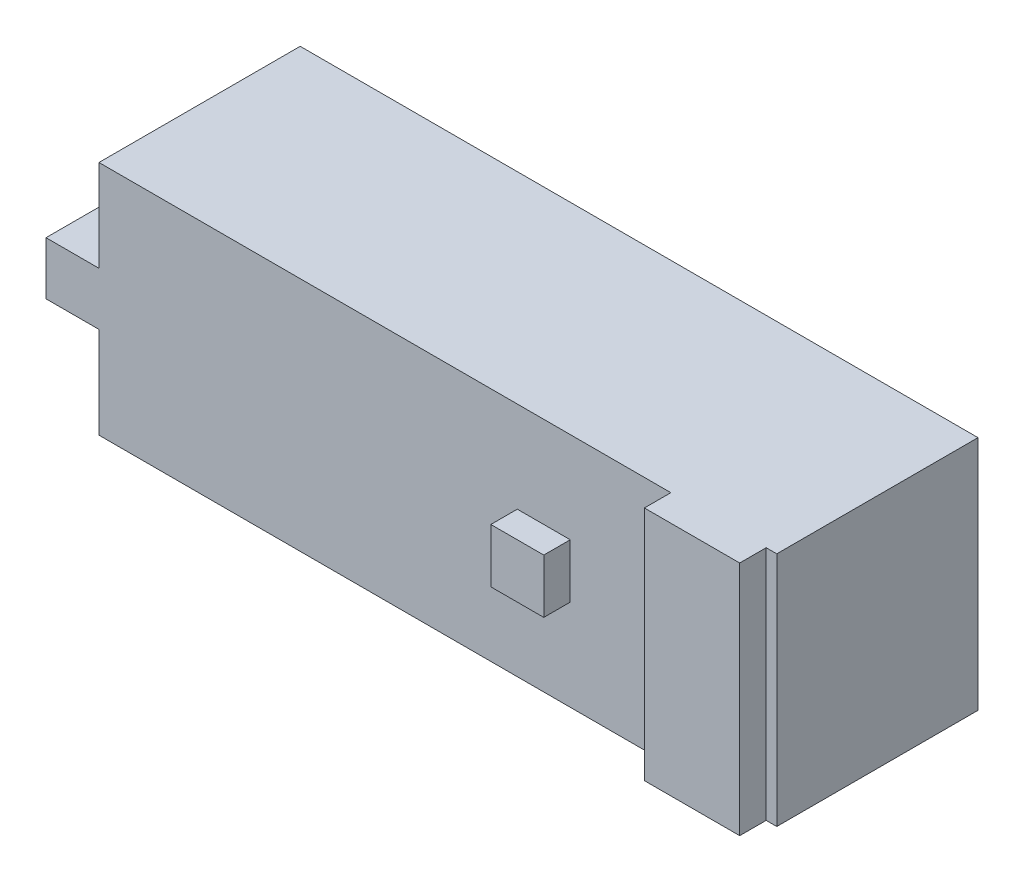
ISO-10303-21;
HEADER;
FILE_DESCRIPTION(('STEP AP214'),'2;1');
FILE_NAME('part.step','',(''),(''),'','','');
FILE_SCHEMA(('AUTOMOTIVE_DESIGN { 1 0 10303 214 1 1 1 1 }'));
ENDSEC;
DATA;
#1=APPLICATION_CONTEXT('core data for automotive mechanical design processes');
#2=APPLICATION_PROTOCOL_DEFINITION('international standard','automotive_design',2000,#1);
#3=PRODUCT_CONTEXT('',#1,'mechanical');
#4=PRODUCT('Part','Part','',(#3));
#5=PRODUCT_RELATED_PRODUCT_CATEGORY('part','',(#4));
#6=PRODUCT_DEFINITION_FORMATION('','',#4);
#7=PRODUCT_DEFINITION_CONTEXT('part definition',#1,'design');
#8=PRODUCT_DEFINITION('design','',#6,#7);
#9=PRODUCT_DEFINITION_SHAPE('','',#8);
#10=(LENGTH_UNIT() NAMED_UNIT(*) SI_UNIT(.MILLI.,.METRE.));
#11=(NAMED_UNIT(*) PLANE_ANGLE_UNIT() SI_UNIT($,.RADIAN.));
#12=(NAMED_UNIT(*) SI_UNIT($,.STERADIAN.) SOLID_ANGLE_UNIT());
#13=UNCERTAINTY_MEASURE_WITH_UNIT(LENGTH_MEASURE(1.E-05),#10,'distance_accuracy_value','');
#14=(GEOMETRIC_REPRESENTATION_CONTEXT(3) GLOBAL_UNCERTAINTY_ASSIGNED_CONTEXT((#13)) GLOBAL_UNIT_ASSIGNED_CONTEXT((#10,
#11,#12)) REPRESENTATION_CONTEXT('',''));
#15=CARTESIAN_POINT('',(0.,0.,0.));
#16=DIRECTION('',(0.,0.,1.));
#17=DIRECTION('',(1.,0.,0.));
#18=AXIS2_PLACEMENT_3D('',#15,#16,#17);
#19=CARTESIAN_POINT('',(0.,0.,19.));
#20=DIRECTION('',(0.,0.,1.));
#21=DIRECTION('',(1.,0.,0.));
#22=AXIS2_PLACEMENT_3D('',#19,#20,#21);
#23=PLANE('',#22);
#24=DIRECTION('',(1.,0.,0.));
#25=VECTOR('',#24,1.);
#26=CARTESIAN_POINT('',(0.,-2.55,19.));
#27=LINE('',#26,#25);
#28=CARTESIAN_POINT('',(7.49999999999999,-2.55,19.));
#29=VERTEX_POINT('',#28);
#30=CARTESIAN_POINT('',(12.5,-2.55,19.));
#31=VERTEX_POINT('',#30);
#32=EDGE_CURVE('E226',#29,#31,#27,.T.);
#33=ORIENTED_EDGE('',*,*,#32,.F.);
#34=DIRECTION('',(0.,-1.,0.));
#35=VECTOR('',#34,1.);
#36=CARTESIAN_POINT('',(7.49999999999999,0.,19.));
#37=LINE('',#36,#35);
#38=CARTESIAN_POINT('',(7.49999999999999,2.55,19.));
#39=VERTEX_POINT('',#38);
#40=EDGE_CURVE('E223',#39,#29,#37,.T.);
#41=ORIENTED_EDGE('',*,*,#40,.F.);
#42=DIRECTION('',(1.,0.,0.));
#43=VECTOR('',#42,1.);
#44=CARTESIAN_POINT('',(0.,2.55,19.));
#45=LINE('',#44,#43);
#46=CARTESIAN_POINT('',(12.5,2.55,19.));
#47=VERTEX_POINT('',#46);
#48=EDGE_CURVE('E236',#39,#47,#45,.T.);
#49=ORIENTED_EDGE('',*,*,#48,.T.);
#50=DIRECTION('',(0.,-1.,0.));
#51=VECTOR('',#50,1.);
#52=CARTESIAN_POINT('',(12.5,0.,19.));
#53=LINE('',#52,#51);
#54=EDGE_CURVE('E247',#47,#31,#53,.T.);
#55=ORIENTED_EDGE('',*,*,#54,.T.);
#56=EDGE_LOOP('',(#33,#41,#49,#55));
#57=FACE_BOUND('',#56,.T.);
#58=DIRECTION('',(1.,0.,0.));
#59=VECTOR('',#58,1.);
#60=CARTESIAN_POINT('',(0.,-11.15,19.));
#61=LINE('',#60,#59);
#62=CARTESIAN_POINT('',(-32.,-11.15,19.));
#63=VERTEX_POINT('',#62);
#64=CARTESIAN_POINT('',(22.,-11.15,19.));
#65=VERTEX_POINT('',#64);
#66=EDGE_CURVE('E341',#63,#65,#61,.T.);
#67=ORIENTED_EDGE('',*,*,#66,.T.);
#68=DIRECTION('',(0.,-1.,0.));
#69=VECTOR('',#68,1.);
#70=CARTESIAN_POINT('',(22.,0.,19.));
#71=LINE('',#70,#69);
#72=CARTESIAN_POINT('',(22.,11.15,19.));
#73=VERTEX_POINT('',#72);
#74=EDGE_CURVE('E60',#73,#65,#71,.T.);
#75=ORIENTED_EDGE('',*,*,#74,.F.);
#76=DIRECTION('',(1.,0.,0.));
#77=VECTOR('',#76,1.);
#78=CARTESIAN_POINT('',(0.,11.15,19.));
#79=LINE('',#78,#77);
#80=CARTESIAN_POINT('',(-32.,11.15,19.));
#81=VERTEX_POINT('',#80);
#82=EDGE_CURVE('E222',#81,#73,#79,.T.);
#83=ORIENTED_EDGE('',*,*,#82,.F.);
#84=DIRECTION('',(0.,-1.,0.));
#85=VECTOR('',#84,1.);
#86=CARTESIAN_POINT('',(-32.,0.,19.));
#87=LINE('',#86,#85);
#88=CARTESIAN_POINT('',(-32.,2.5,19.));
#89=VERTEX_POINT('',#88);
#90=EDGE_CURVE('E331',#81,#89,#87,.T.);
#91=ORIENTED_EDGE('',*,*,#90,.T.);
#92=DIRECTION('',(-1.,0.,0.));
#93=VECTOR('',#92,1.);
#94=CARTESIAN_POINT('',(0.,2.5,19.));
#95=LINE('',#94,#93);
#96=CARTESIAN_POINT('',(-37.,2.5,19.));
#97=VERTEX_POINT('',#96);
#98=EDGE_CURVE('E333',#89,#97,#95,.T.);
#99=ORIENTED_EDGE('',*,*,#98,.T.);
#100=DIRECTION('',(0.,-1.,0.));
#101=VECTOR('',#100,1.);
#102=CARTESIAN_POINT('',(-37.,0.,19.));
#103=LINE('',#102,#101);
#104=CARTESIAN_POINT('',(-37.,-2.5,19.));
#105=VERTEX_POINT('',#104);
#106=EDGE_CURVE('E336',#97,#105,#103,.T.);
#107=ORIENTED_EDGE('',*,*,#106,.T.);
#108=DIRECTION('',(-1.,0.,0.));
#109=VECTOR('',#108,1.);
#110=CARTESIAN_POINT('',(0.,-2.5,19.));
#111=LINE('',#110,#109);
#112=CARTESIAN_POINT('',(-32.,-2.5,19.));
#113=VERTEX_POINT('',#112);
#114=EDGE_CURVE('E338',#113,#105,#111,.T.);
#115=ORIENTED_EDGE('',*,*,#114,.F.);
#116=EDGE_CURVE('E334',#113,#63,#87,.T.);
#117=ORIENTED_EDGE('',*,*,#116,.T.);
#118=EDGE_LOOP('',(#67,#75,#83,#91,#99,#107,#115,#117));
#119=FACE_BOUND('',#118,.T.);
#120=ADVANCED_FACE('F37',(#57,#119),#23,.T.);
#121=DIRECTION('',(0.,-1.,0.));
#122=VECTOR('',#121,1.);
#123=CARTESIAN_POINT('',(31.,0.,19.));
#124=LINE('',#123,#122);
#125=CARTESIAN_POINT('',(31.,11.15,19.));
#126=VERTEX_POINT('',#125);
#127=CARTESIAN_POINT('',(31.,-11.15,19.));
#128=VERTEX_POINT('',#127);
#129=EDGE_CURVE('E218',#126,#128,#124,.T.);
#130=ORIENTED_EDGE('',*,*,#129,.T.);
#131=CARTESIAN_POINT('',(32.,-11.15,19.));
#132=VERTEX_POINT('',#131);
#133=EDGE_CURVE('E344',#128,#132,#61,.T.);
#134=ORIENTED_EDGE('',*,*,#133,.T.);
#135=DIRECTION('',(0.,-1.,0.));
#136=VECTOR('',#135,1.);
#137=CARTESIAN_POINT('',(32.,0.,19.));
#138=LINE('',#137,#136);
#139=CARTESIAN_POINT('',(32.,11.15,19.));
#140=VERTEX_POINT('',#139);
#141=EDGE_CURVE('E326',#140,#132,#138,.T.);
#142=ORIENTED_EDGE('',*,*,#141,.F.);
#143=EDGE_CURVE('E52',#126,#140,#79,.T.);
#144=ORIENTED_EDGE('',*,*,#143,.F.);
#145=EDGE_LOOP('',(#130,#134,#142,#144));
#146=FACE_BOUND('',#145,.T.);
#147=ADVANCED_FACE('F411',(#146),#23,.T.);
#148=CARTESIAN_POINT('',(0.,0.,0.));
#149=DIRECTION('',(0.,0.,1.));
#150=DIRECTION('',(1.,0.,0.));
#151=AXIS2_PLACEMENT_3D('',#148,#149,#150);
#152=PLANE('',#151);
#153=DIRECTION('',(0.,1.,0.));
#154=VECTOR('',#153,1.);
#155=CARTESIAN_POINT('',(7.49999999999999,2.55,0.));
#156=LINE('',#155,#154);
#157=CARTESIAN_POINT('',(7.49999999999999,-2.55,0.));
#158=VERTEX_POINT('',#157);
#159=CARTESIAN_POINT('',(7.49999999999999,2.55,0.));
#160=VERTEX_POINT('',#159);
#161=EDGE_CURVE('E264',#158,#160,#156,.T.);
#162=ORIENTED_EDGE('',*,*,#161,.F.);
#163=DIRECTION('',(-1.,0.,0.));
#164=VECTOR('',#163,1.);
#165=CARTESIAN_POINT('',(7.49999999999999,-2.55,0.));
#166=LINE('',#165,#164);
#167=CARTESIAN_POINT('',(12.5,-2.55,0.));
#168=VERTEX_POINT('',#167);
#169=EDGE_CURVE('E269',#168,#158,#166,.T.);
#170=ORIENTED_EDGE('',*,*,#169,.F.);
#171=DIRECTION('',(0.,-1.,0.));
#172=VECTOR('',#171,1.);
#173=CARTESIAN_POINT('',(12.5,2.55,0.));
#174=LINE('',#173,#172);
#175=CARTESIAN_POINT('',(12.5,2.55,0.));
#176=VERTEX_POINT('',#175);
#177=EDGE_CURVE('E281',#176,#168,#174,.T.);
#178=ORIENTED_EDGE('',*,*,#177,.F.);
#179=DIRECTION('',(1.,0.,0.));
#180=VECTOR('',#179,1.);
#181=CARTESIAN_POINT('',(7.49999999999999,2.55,0.));
#182=LINE('',#181,#180);
#183=EDGE_CURVE('E278',#160,#176,#182,.T.);
#184=ORIENTED_EDGE('',*,*,#183,.F.);
#185=EDGE_LOOP('',(#162,#170,#178,#184));
#186=FACE_BOUND('',#185,.T.);
#187=DIRECTION('',(0.,-1.,0.));
#188=VECTOR('',#187,1.);
#189=CARTESIAN_POINT('',(32.,0.,0.));
#190=LINE('',#189,#188);
#191=CARTESIAN_POINT('',(32.,11.15,0.));
#192=VERTEX_POINT('',#191);
#193=CARTESIAN_POINT('',(32.,-11.15,0.));
#194=VERTEX_POINT('',#193);
#195=EDGE_CURVE('E318',#192,#194,#190,.T.);
#196=ORIENTED_EDGE('',*,*,#195,.T.);
#197=DIRECTION('',(1.,0.,0.));
#198=VECTOR('',#197,1.);
#199=CARTESIAN_POINT('',(0.,-11.15,0.));
#200=LINE('',#199,#198);
#201=CARTESIAN_POINT('',(-32.,-11.15,0.));
#202=VERTEX_POINT('',#201);
#203=EDGE_CURVE('E329',#202,#194,#200,.T.);
#204=ORIENTED_EDGE('',*,*,#203,.F.);
#205=DIRECTION('',(0.,-1.,0.));
#206=VECTOR('',#205,1.);
#207=CARTESIAN_POINT('',(-32.,0.,0.));
#208=LINE('',#207,#206);
#209=CARTESIAN_POINT('',(-32.,-2.5,0.));
#210=VERTEX_POINT('',#209);
#211=EDGE_CURVE('E353',#210,#202,#208,.T.);
#212=ORIENTED_EDGE('',*,*,#211,.F.);
#213=DIRECTION('',(-1.,0.,0.));
#214=VECTOR('',#213,1.);
#215=CARTESIAN_POINT('',(0.,-2.5,0.));
#216=LINE('',#215,#214);
#217=CARTESIAN_POINT('',(-37.,-2.5,0.));
#218=VERTEX_POINT('',#217);
#219=EDGE_CURVE('E358',#210,#218,#216,.T.);
#220=ORIENTED_EDGE('',*,*,#219,.T.);
#221=DIRECTION('',(0.,-1.,0.));
#222=VECTOR('',#221,1.);
#223=CARTESIAN_POINT('',(-37.,0.,0.));
#224=LINE('',#223,#222);
#225=CARTESIAN_POINT('',(-37.,2.5,0.));
#226=VERTEX_POINT('',#225);
#227=EDGE_CURVE('E355',#226,#218,#224,.T.);
#228=ORIENTED_EDGE('',*,*,#227,.F.);
#229=DIRECTION('',(-1.,0.,0.));
#230=VECTOR('',#229,1.);
#231=CARTESIAN_POINT('',(0.,2.5,0.));
#232=LINE('',#231,#230);
#233=CARTESIAN_POINT('',(-32.,2.5,0.));
#234=VERTEX_POINT('',#233);
#235=EDGE_CURVE('E352',#234,#226,#232,.T.);
#236=ORIENTED_EDGE('',*,*,#235,.F.);
#237=CARTESIAN_POINT('',(-32.,11.15,0.));
#238=VERTEX_POINT('',#237);
#239=EDGE_CURVE('E350',#238,#234,#208,.T.);
#240=ORIENTED_EDGE('',*,*,#239,.F.);
#241=DIRECTION('',(1.,0.,0.));
#242=VECTOR('',#241,1.);
#243=CARTESIAN_POINT('',(0.,11.15,0.));
#244=LINE('',#243,#242);
#245=EDGE_CURVE('E347',#238,#192,#244,.T.);
#246=ORIENTED_EDGE('',*,*,#245,.T.);
#247=EDGE_LOOP('',(#196,#204,#212,#220,#228,#236,#240,#246));
#248=FACE_BOUND('',#247,.T.);
#249=DIRECTION('',(1.,0.,0.));
#250=VECTOR('',#249,1.);
#251=CARTESIAN_POINT('',(0.,1.825,0.));
#252=LINE('',#251,#250);
#253=CARTESIAN_POINT('',(-23.,1.825,0.));
#254=VERTEX_POINT('',#253);
#255=CARTESIAN_POINT('',(-19.,1.825,0.));
#256=VERTEX_POINT('',#255);
#257=EDGE_CURVE('E297',#254,#256,#252,.T.);
#258=ORIENTED_EDGE('',*,*,#257,.F.);
#259=CARTESIAN_POINT('',(-21.,0.,0.));
#260=DIRECTION('',(0.,0.,1.));
#261=DIRECTION('',(1.,0.,0.));
#262=AXIS2_PLACEMENT_3D('',#259,#260,#261);
#263=CIRCLE('',#262,2.70751269618445);
#264=CARTESIAN_POINT('',(-23.,-1.825,0.));
#265=VERTEX_POINT('',#264);
#266=EDGE_CURVE('E310',#254,#265,#263,.T.);
#267=ORIENTED_EDGE('',*,*,#266,.T.);
#268=DIRECTION('',(1.,0.,0.));
#269=VECTOR('',#268,1.);
#270=CARTESIAN_POINT('',(0.,-1.825,0.));
#271=LINE('',#270,#269);
#272=CARTESIAN_POINT('',(-19.,-1.825,0.));
#273=VERTEX_POINT('',#272);
#274=EDGE_CURVE('E313',#265,#273,#271,.T.);
#275=ORIENTED_EDGE('',*,*,#274,.T.);
#276=EDGE_CURVE('E301',#273,#256,#263,.T.);
#277=ORIENTED_EDGE('',*,*,#276,.T.);
#278=EDGE_LOOP('',(#258,#267,#275,#277));
#279=FACE_BOUND('',#278,.T.);
#280=CARTESIAN_POINT('',(-10.,0.,0.));
#281=DIRECTION('',(0.,0.,1.));
#282=DIRECTION('',(1.,0.,0.));
#283=AXIS2_PLACEMENT_3D('',#280,#281,#282);
#284=CIRCLE('',#283,2.1);
#285=CARTESIAN_POINT('',(-7.90000000000001,0.,0.));
#286=VERTEX_POINT('',#285);
#287=EDGE_CURVE('E11',#286,#286,#284,.F.);
#288=ORIENTED_EDGE('',*,*,#287,.F.);
#289=EDGE_LOOP('',(#288));
#290=FACE_BOUND('',#289,.T.);
#291=ADVANCED_FACE('F385',(#186,#248,#279,#290),#152,.F.);
#292=CARTESIAN_POINT('',(32.,0.,19.));
#293=DIRECTION('',(1.,0.,0.));
#294=DIRECTION('',(0.,1.,0.));
#295=AXIS2_PLACEMENT_3D('',#292,#293,#294);
#296=PLANE('',#295);
#297=ORIENTED_EDGE('',*,*,#195,.F.);
#298=DIRECTION('',(0.,0.,-1.));
#299=VECTOR('',#298,1.);
#300=CARTESIAN_POINT('',(32.,11.15,19.));
#301=LINE('',#300,#299);
#302=EDGE_CURVE('E45',#140,#192,#301,.T.);
#303=ORIENTED_EDGE('',*,*,#302,.F.);
#304=ORIENTED_EDGE('',*,*,#141,.T.);
#305=DIRECTION('',(0.,0.,-1.));
#306=VECTOR('',#305,1.);
#307=CARTESIAN_POINT('',(32.,-11.15,19.));
#308=LINE('',#307,#306);
#309=EDGE_CURVE('E343',#132,#194,#308,.T.);
#310=ORIENTED_EDGE('',*,*,#309,.T.);
#311=EDGE_LOOP('',(#297,#303,#304,#310));
#312=FACE_BOUND('',#311,.T.);
#313=ADVANCED_FACE('F39',(#312),#296,.T.);
#314=CARTESIAN_POINT('',(0.,11.15,19.));
#315=DIRECTION('',(0.,1.,0.));
#316=DIRECTION('',(0.,0.,1.));
#317=AXIS2_PLACEMENT_3D('',#314,#315,#316);
#318=PLANE('',#317);
#319=ORIENTED_EDGE('',*,*,#245,.F.);
#320=DIRECTION('',(0.,0.,-1.));
#321=VECTOR('',#320,1.);
#322=CARTESIAN_POINT('',(-32.,11.15,19.));
#323=LINE('',#322,#321);
#324=EDGE_CURVE('E377',#81,#238,#323,.T.);
#325=ORIENTED_EDGE('',*,*,#324,.F.);
#326=ORIENTED_EDGE('',*,*,#82,.T.);
#327=DIRECTION('',(0.,0.,-1.));
#328=VECTOR('',#327,1.);
#329=CARTESIAN_POINT('',(22.,11.15,21.5));
#330=LINE('',#329,#328);
#331=CARTESIAN_POINT('',(22.,11.15,21.5));
#332=VERTEX_POINT('',#331);
#333=EDGE_CURVE('E204',#332,#73,#330,.T.);
#334=ORIENTED_EDGE('',*,*,#333,.F.);
#335=DIRECTION('',(-1.,0.,0.));
#336=VECTOR('',#335,1.);
#337=CARTESIAN_POINT('',(0.,11.15,21.5));
#338=LINE('',#337,#336);
#339=CARTESIAN_POINT('',(31.,11.15,21.5));
#340=VERTEX_POINT('',#339);
#341=EDGE_CURVE('E210',#340,#332,#338,.T.);
#342=ORIENTED_EDGE('',*,*,#341,.F.);
#343=DIRECTION('',(0.,0.,-1.));
#344=VECTOR('',#343,1.);
#345=CARTESIAN_POINT('',(31.,11.15,21.5));
#346=LINE('',#345,#344);
#347=EDGE_CURVE('E422',#340,#126,#346,.T.);
#348=ORIENTED_EDGE('',*,*,#347,.T.);
#349=ORIENTED_EDGE('',*,*,#143,.T.);
#350=ORIENTED_EDGE('',*,*,#302,.T.);
#351=EDGE_LOOP('',(#319,#325,#326,#334,#342,#348,#349,#350));
#352=FACE_BOUND('',#351,.T.);
#353=ADVANCED_FACE('F221',(#352),#318,.T.);
#354=CARTESIAN_POINT('',(-32.,0.,19.));
#355=DIRECTION('',(1.,0.,0.));
#356=DIRECTION('',(0.,0.,-1.));
#357=AXIS2_PLACEMENT_3D('',#354,#355,#356);
#358=PLANE('',#357);
#359=ORIENTED_EDGE('',*,*,#239,.T.);
#360=DIRECTION('',(0.,0.,-1.));
#361=VECTOR('',#360,1.);
#362=CARTESIAN_POINT('',(-32.,2.5,19.));
#363=LINE('',#362,#361);
#364=EDGE_CURVE('E374',#89,#234,#363,.T.);
#365=ORIENTED_EDGE('',*,*,#364,.F.);
#366=ORIENTED_EDGE('',*,*,#90,.F.);
#367=ORIENTED_EDGE('',*,*,#324,.T.);
#368=EDGE_LOOP('',(#359,#365,#366,#367));
#369=FACE_BOUND('',#368,.T.);
#370=ADVANCED_FACE('F391',(#369),#358,.F.);
#371=CARTESIAN_POINT('',(0.,2.5,19.));
#372=DIRECTION('',(0.,-1.,0.));
#373=DIRECTION('',(1.,0.,0.));
#374=AXIS2_PLACEMENT_3D('',#371,#372,#373);
#375=PLANE('',#374);
#376=ORIENTED_EDGE('',*,*,#235,.T.);
#377=DIRECTION('',(0.,0.,-1.));
#378=VECTOR('',#377,1.);
#379=CARTESIAN_POINT('',(-37.,2.5,19.));
#380=LINE('',#379,#378);
#381=EDGE_CURVE('E371',#97,#226,#380,.T.);
#382=ORIENTED_EDGE('',*,*,#381,.F.);
#383=ORIENTED_EDGE('',*,*,#98,.F.);
#384=ORIENTED_EDGE('',*,*,#364,.T.);
#385=EDGE_LOOP('',(#376,#382,#383,#384));
#386=FACE_BOUND('',#385,.T.);
#387=ADVANCED_FACE('F395',(#386),#375,.F.);
#388=CARTESIAN_POINT('',(-37.,0.,19.));
#389=DIRECTION('',(1.,0.,0.));
#390=DIRECTION('',(0.,0.,-1.));
#391=AXIS2_PLACEMENT_3D('',#388,#389,#390);
#392=PLANE('',#391);
#393=ORIENTED_EDGE('',*,*,#227,.T.);
#394=DIRECTION('',(0.,0.,-1.));
#395=VECTOR('',#394,1.);
#396=CARTESIAN_POINT('',(-37.,-2.5,19.));
#397=LINE('',#396,#395);
#398=EDGE_CURVE('E369',#105,#218,#397,.T.);
#399=ORIENTED_EDGE('',*,*,#398,.F.);
#400=ORIENTED_EDGE('',*,*,#106,.F.);
#401=ORIENTED_EDGE('',*,*,#381,.T.);
#402=EDGE_LOOP('',(#393,#399,#400,#401));
#403=FACE_BOUND('',#402,.T.);
#404=ADVANCED_FACE('F401',(#403),#392,.F.);
#405=CARTESIAN_POINT('',(0.,-2.5,19.));
#406=DIRECTION('',(0.,-1.,0.));
#407=DIRECTION('',(1.,0.,0.));
#408=AXIS2_PLACEMENT_3D('',#405,#406,#407);
#409=PLANE('',#408);
#410=ORIENTED_EDGE('',*,*,#219,.F.);
#411=DIRECTION('',(0.,0.,-1.));
#412=VECTOR('',#411,1.);
#413=CARTESIAN_POINT('',(-32.,-2.5,19.));
#414=LINE('',#413,#412);
#415=EDGE_CURVE('E367',#113,#210,#414,.T.);
#416=ORIENTED_EDGE('',*,*,#415,.F.);
#417=ORIENTED_EDGE('',*,*,#114,.T.);
#418=ORIENTED_EDGE('',*,*,#398,.T.);
#419=EDGE_LOOP('',(#410,#416,#417,#418));
#420=FACE_BOUND('',#419,.T.);
#421=ADVANCED_FACE('F404',(#420),#409,.T.);
#422=ORIENTED_EDGE('',*,*,#211,.T.);
#423=DIRECTION('',(0.,0.,-1.));
#424=VECTOR('',#423,1.);
#425=CARTESIAN_POINT('',(-32.,-11.15,19.));
#426=LINE('',#425,#424);
#427=EDGE_CURVE('E364',#63,#202,#426,.T.);
#428=ORIENTED_EDGE('',*,*,#427,.F.);
#429=ORIENTED_EDGE('',*,*,#116,.F.);
#430=ORIENTED_EDGE('',*,*,#415,.T.);
#431=EDGE_LOOP('',(#422,#428,#429,#430));
#432=FACE_BOUND('',#431,.T.);
#433=ADVANCED_FACE('F409',(#432),#358,.F.);
#434=CARTESIAN_POINT('',(0.,-11.15,19.));
#435=DIRECTION('',(0.,1.,0.));
#436=DIRECTION('',(0.,0.,1.));
#437=AXIS2_PLACEMENT_3D('',#434,#435,#436);
#438=PLANE('',#437);
#439=ORIENTED_EDGE('',*,*,#203,.T.);
#440=ORIENTED_EDGE('',*,*,#309,.F.);
#441=ORIENTED_EDGE('',*,*,#133,.F.);
#442=DIRECTION('',(0.,0.,-1.));
#443=VECTOR('',#442,1.);
#444=CARTESIAN_POINT('',(31.,-11.15,21.5));
#445=LINE('',#444,#443);
#446=CARTESIAN_POINT('',(31.,-11.15,21.5));
#447=VERTEX_POINT('',#446);
#448=EDGE_CURVE('E228',#447,#128,#445,.T.);
#449=ORIENTED_EDGE('',*,*,#448,.F.);
#450=DIRECTION('',(1.,0.,0.));
#451=VECTOR('',#450,1.);
#452=CARTESIAN_POINT('',(0.,-11.15,21.5));
#453=LINE('',#452,#451);
#454=CARTESIAN_POINT('',(22.,-11.15,21.5));
#455=VERTEX_POINT('',#454);
#456=EDGE_CURVE('E209',#455,#447,#453,.T.);
#457=ORIENTED_EDGE('',*,*,#456,.F.);
#458=DIRECTION('',(0.,0.,-1.));
#459=VECTOR('',#458,1.);
#460=CARTESIAN_POINT('',(22.,-11.15,21.5));
#461=LINE('',#460,#459);
#462=EDGE_CURVE('E206',#455,#65,#461,.T.);
#463=ORIENTED_EDGE('',*,*,#462,.T.);
#464=ORIENTED_EDGE('',*,*,#66,.F.);
#465=ORIENTED_EDGE('',*,*,#427,.T.);
#466=EDGE_LOOP('',(#439,#440,#441,#449,#457,#463,#464,#465));
#467=FACE_BOUND('',#466,.T.);
#468=ADVANCED_FACE('F416',(#467),#438,.F.);
#469=CARTESIAN_POINT('',(0.,1.825,-8.));
#470=DIRECTION('',(0.,-1.,0.));
#471=DIRECTION('',(0.,0.,-1.));
#472=AXIS2_PLACEMENT_3D('',#469,#470,#471);
#473=PLANE('',#472);
#474=ORIENTED_EDGE('',*,*,#257,.T.);
#475=DIRECTION('',(0.,0.,1.));
#476=VECTOR('',#475,1.);
#477=CARTESIAN_POINT('',(-19.,1.825,-8.));
#478=LINE('',#477,#476);
#479=CARTESIAN_POINT('',(-19.,1.825,-8.));
#480=VERTEX_POINT('',#479);
#481=EDGE_CURVE('E316',#480,#256,#478,.T.);
#482=ORIENTED_EDGE('',*,*,#481,.F.);
#483=DIRECTION('',(1.,0.,0.));
#484=VECTOR('',#483,1.);
#485=CARTESIAN_POINT('',(0.,1.825,-8.));
#486=LINE('',#485,#484);
#487=CARTESIAN_POINT('',(-23.,1.825,-8.));
#488=VERTEX_POINT('',#487);
#489=EDGE_CURVE('E298',#488,#480,#486,.T.);
#490=ORIENTED_EDGE('',*,*,#489,.F.);
#491=DIRECTION('',(0.,0.,1.));
#492=VECTOR('',#491,1.);
#493=CARTESIAN_POINT('',(-23.,1.825,-8.));
#494=LINE('',#493,#492);
#495=EDGE_CURVE('E324',#488,#254,#494,.T.);
#496=ORIENTED_EDGE('',*,*,#495,.T.);
#497=EDGE_LOOP('',(#474,#482,#490,#496));
#498=FACE_BOUND('',#497,.T.);
#499=ADVANCED_FACE('F442',(#498),#473,.F.);
#500=CARTESIAN_POINT('',(-21.,0.,-8.));
#501=DIRECTION('',(0.,0.,1.));
#502=DIRECTION('',(1.,0.,0.));
#503=AXIS2_PLACEMENT_3D('',#500,#501,#502);
#504=CYLINDRICAL_SURFACE('',#503,2.70751269618445);
#505=ORIENTED_EDGE('',*,*,#276,.F.);
#506=DIRECTION('',(0.,0.,1.));
#507=VECTOR('',#506,1.);
#508=CARTESIAN_POINT('',(-19.,-1.825,-8.));
#509=LINE('',#508,#507);
#510=CARTESIAN_POINT('',(-19.,-1.825,-8.));
#511=VERTEX_POINT('',#510);
#512=EDGE_CURVE('E319',#511,#273,#509,.T.);
#513=ORIENTED_EDGE('',*,*,#512,.F.);
#514=CARTESIAN_POINT('',(-21.,0.,-8.));
#515=DIRECTION('',(0.,0.,1.));
#516=DIRECTION('',(1.,0.,0.));
#517=AXIS2_PLACEMENT_3D('',#514,#515,#516);
#518=CIRCLE('',#517,2.70751269618445);
#519=EDGE_CURVE('E305',#511,#480,#518,.T.);
#520=ORIENTED_EDGE('',*,*,#519,.T.);
#521=ORIENTED_EDGE('',*,*,#481,.T.);
#522=EDGE_LOOP('',(#505,#513,#520,#521));
#523=FACE_BOUND('',#522,.T.);
#524=ADVANCED_FACE('F595',(#523),#504,.T.);
#525=CARTESIAN_POINT('',(0.,-1.825,-8.));
#526=DIRECTION('',(0.,-1.,0.));
#527=DIRECTION('',(0.,0.,-1.));
#528=AXIS2_PLACEMENT_3D('',#525,#526,#527);
#529=PLANE('',#528);
#530=ORIENTED_EDGE('',*,*,#274,.F.);
#531=DIRECTION('',(0.,0.,1.));
#532=VECTOR('',#531,1.);
#533=CARTESIAN_POINT('',(-23.,-1.825,-8.));
#534=LINE('',#533,#532);
#535=CARTESIAN_POINT('',(-23.,-1.825,-8.));
#536=VERTEX_POINT('',#535);
#537=EDGE_CURVE('E321',#536,#265,#534,.T.);
#538=ORIENTED_EDGE('',*,*,#537,.F.);
#539=DIRECTION('',(1.,0.,0.));
#540=VECTOR('',#539,1.);
#541=CARTESIAN_POINT('',(0.,-1.825,-8.));
#542=LINE('',#541,#540);
#543=EDGE_CURVE('E304',#536,#511,#542,.T.);
#544=ORIENTED_EDGE('',*,*,#543,.T.);
#545=ORIENTED_EDGE('',*,*,#512,.T.);
#546=EDGE_LOOP('',(#530,#538,#544,#545));
#547=FACE_BOUND('',#546,.T.);
#548=ADVANCED_FACE('F597',(#547),#529,.T.);
#549=ORIENTED_EDGE('',*,*,#266,.F.);
#550=ORIENTED_EDGE('',*,*,#495,.F.);
#551=EDGE_CURVE('E300',#488,#536,#518,.T.);
#552=ORIENTED_EDGE('',*,*,#551,.T.);
#553=ORIENTED_EDGE('',*,*,#537,.T.);
#554=EDGE_LOOP('',(#549,#550,#552,#553));
#555=FACE_BOUND('',#554,.T.);
#556=ADVANCED_FACE('F593',(#555),#504,.T.);
#557=CARTESIAN_POINT('',(0.,0.,-8.));
#558=DIRECTION('',(0.,0.,1.));
#559=DIRECTION('',(1.,0.,0.));
#560=AXIS2_PLACEMENT_3D('',#557,#558,#559);
#561=PLANE('',#560);
#562=ORIENTED_EDGE('',*,*,#489,.T.);
#563=ORIENTED_EDGE('',*,*,#519,.F.);
#564=ORIENTED_EDGE('',*,*,#543,.F.);
#565=ORIENTED_EDGE('',*,*,#551,.F.);
#566=EDGE_LOOP('',(#562,#563,#564,#565));
#567=FACE_BOUND('',#566,.T.);
#568=ADVANCED_FACE('F589',(#567),#561,.F.);
#569=CARTESIAN_POINT('',(7.49999999999999,2.55,-2.));
#570=DIRECTION('',(1.,0.,0.));
#571=DIRECTION('',(0.,0.,-1.));
#572=AXIS2_PLACEMENT_3D('',#569,#570,#571);
#573=PLANE('',#572);
#574=ORIENTED_EDGE('',*,*,#161,.T.);
#575=DIRECTION('',(0.,0.,1.));
#576=VECTOR('',#575,1.);
#577=CARTESIAN_POINT('',(7.49999999999999,2.55,-2.));
#578=LINE('',#577,#576);
#579=CARTESIAN_POINT('',(7.49999999999999,2.55,-2.));
#580=VERTEX_POINT('',#579);
#581=EDGE_CURVE('E294',#580,#160,#578,.T.);
#582=ORIENTED_EDGE('',*,*,#581,.F.);
#583=DIRECTION('',(0.,1.,0.));
#584=VECTOR('',#583,1.);
#585=CARTESIAN_POINT('',(7.49999999999999,2.55,-2.));
#586=LINE('',#585,#584);
#587=CARTESIAN_POINT('',(7.49999999999999,-2.55,-2.));
#588=VERTEX_POINT('',#587);
#589=EDGE_CURVE('E265',#588,#580,#586,.T.);
#590=ORIENTED_EDGE('',*,*,#589,.F.);
#591=DIRECTION('',(0.,0.,1.));
#592=VECTOR('',#591,1.);
#593=CARTESIAN_POINT('',(7.49999999999999,-2.55,-2.));
#594=LINE('',#593,#592);
#595=EDGE_CURVE('E275',#588,#158,#594,.T.);
#596=ORIENTED_EDGE('',*,*,#595,.T.);
#597=EDGE_LOOP('',(#574,#582,#590,#596));
#598=FACE_BOUND('',#597,.T.);
#599=ADVANCED_FACE('F585',(#598),#573,.F.);
#600=CARTESIAN_POINT('',(7.49999999999999,2.55,-2.));
#601=DIRECTION('',(0.,-1.,0.));
#602=DIRECTION('',(0.,0.,-1.));
#603=AXIS2_PLACEMENT_3D('',#600,#601,#602);
#604=PLANE('',#603);
#605=ORIENTED_EDGE('',*,*,#183,.T.);
#606=DIRECTION('',(0.,0.,1.));
#607=VECTOR('',#606,1.);
#608=CARTESIAN_POINT('',(12.5,2.55,-2.));
#609=LINE('',#608,#607);
#610=CARTESIAN_POINT('',(12.5,2.55,-2.));
#611=VERTEX_POINT('',#610);
#612=EDGE_CURVE('E291',#611,#176,#609,.T.);
#613=ORIENTED_EDGE('',*,*,#612,.F.);
#614=DIRECTION('',(1.,0.,0.));
#615=VECTOR('',#614,1.);
#616=CARTESIAN_POINT('',(7.49999999999999,2.55,-2.));
#617=LINE('',#616,#615);
#618=EDGE_CURVE('E268',#580,#611,#617,.T.);
#619=ORIENTED_EDGE('',*,*,#618,.F.);
#620=ORIENTED_EDGE('',*,*,#581,.T.);
#621=EDGE_LOOP('',(#605,#613,#619,#620));
#622=FACE_BOUND('',#621,.T.);
#623=ADVANCED_FACE('F581',(#622),#604,.F.);
#624=CARTESIAN_POINT('',(12.5,2.55,-2.));
#625=DIRECTION('',(-1.,0.,0.));
#626=DIRECTION('',(0.,0.,1.));
#627=AXIS2_PLACEMENT_3D('',#624,#625,#626);
#628=PLANE('',#627);
#629=ORIENTED_EDGE('',*,*,#177,.T.);
#630=DIRECTION('',(0.,0.,1.));
#631=VECTOR('',#630,1.);
#632=CARTESIAN_POINT('',(12.5,-2.55,-2.));
#633=LINE('',#632,#631);
#634=CARTESIAN_POINT('',(12.5,-2.55,-2.));
#635=VERTEX_POINT('',#634);
#636=EDGE_CURVE('E288',#635,#168,#633,.T.);
#637=ORIENTED_EDGE('',*,*,#636,.F.);
#638=DIRECTION('',(0.,-1.,0.));
#639=VECTOR('',#638,1.);
#640=CARTESIAN_POINT('',(12.5,2.55,-2.));
#641=LINE('',#640,#639);
#642=EDGE_CURVE('E271',#611,#635,#641,.T.);
#643=ORIENTED_EDGE('',*,*,#642,.F.);
#644=ORIENTED_EDGE('',*,*,#612,.T.);
#645=EDGE_LOOP('',(#629,#637,#643,#644));
#646=FACE_BOUND('',#645,.T.);
#647=ADVANCED_FACE('F577',(#646),#628,.F.);
#648=CARTESIAN_POINT('',(7.49999999999999,-2.55,-2.));
#649=DIRECTION('',(0.,1.,0.));
#650=DIRECTION('',(0.,0.,1.));
#651=AXIS2_PLACEMENT_3D('',#648,#649,#650);
#652=PLANE('',#651);
#653=ORIENTED_EDGE('',*,*,#169,.T.);
#654=ORIENTED_EDGE('',*,*,#595,.F.);
#655=DIRECTION('',(-1.,0.,0.));
#656=VECTOR('',#655,1.);
#657=CARTESIAN_POINT('',(7.49999999999999,-2.55,-2.));
#658=LINE('',#657,#656);
#659=EDGE_CURVE('E273',#635,#588,#658,.T.);
#660=ORIENTED_EDGE('',*,*,#659,.F.);
#661=ORIENTED_EDGE('',*,*,#636,.T.);
#662=EDGE_LOOP('',(#653,#654,#660,#661));
#663=FACE_BOUND('',#662,.T.);
#664=ADVANCED_FACE('F573',(#663),#652,.F.);
#665=CARTESIAN_POINT('',(0.,0.,-2.));
#666=DIRECTION('',(0.,0.,1.));
#667=DIRECTION('',(1.,0.,0.));
#668=AXIS2_PLACEMENT_3D('',#665,#666,#667);
#669=PLANE('',#668);
#670=ORIENTED_EDGE('',*,*,#589,.T.);
#671=ORIENTED_EDGE('',*,*,#618,.T.);
#672=ORIENTED_EDGE('',*,*,#642,.T.);
#673=ORIENTED_EDGE('',*,*,#659,.T.);
#674=EDGE_LOOP('',(#670,#671,#672,#673));
#675=FACE_BOUND('',#674,.T.);
#676=ADVANCED_FACE('F569',(#675),#669,.F.);
#677=CARTESIAN_POINT('',(-10.,0.,-2.));
#678=DIRECTION('',(0.,0.,1.));
#679=DIRECTION('',(1.,0.,0.));
#680=AXIS2_PLACEMENT_3D('',#677,#678,#679);
#681=CYLINDRICAL_SURFACE('',#680,2.1);
#682=CARTESIAN_POINT('',(-10.,0.,-2.));
#683=DIRECTION('',(0.,0.,-1.));
#684=DIRECTION('',(-1.,0.,0.));
#685=AXIS2_PLACEMENT_3D('',#682,#683,#684);
#686=CIRCLE('',#685,2.1);
#687=CARTESIAN_POINT('',(-12.1,0.,-2.));
#688=VERTEX_POINT('',#687);
#689=EDGE_CURVE('E261',#688,#688,#686,.T.);
#690=ORIENTED_EDGE('',*,*,#689,.F.);
#691=EDGE_LOOP('',(#690));
#692=FACE_BOUND('',#691,.T.);
#693=ORIENTED_EDGE('',*,*,#287,.T.);
#694=EDGE_LOOP('',(#693));
#695=FACE_BOUND('',#694,.T.);
#696=ADVANCED_FACE('F565',(#692,#695),#681,.T.);
#697=CARTESIAN_POINT('',(-10.,0.,-2.));
#698=DIRECTION('',(0.,0.,-1.));
#699=DIRECTION('',(-1.,0.,0.));
#700=AXIS2_PLACEMENT_3D('',#697,#698,#699);
#701=PLANE('',#700);
#702=ORIENTED_EDGE('',*,*,#689,.T.);
#703=EDGE_LOOP('',(#702));
#704=FACE_BOUND('',#703,.T.);
#705=ADVANCED_FACE('F503',(#704),#701,.T.);
#706=CARTESIAN_POINT('',(7.49999999999999,0.,21.5));
#707=DIRECTION('',(1.,0.,0.));
#708=DIRECTION('',(0.,0.,-1.));
#709=AXIS2_PLACEMENT_3D('',#706,#707,#708);
#710=PLANE('',#709);
#711=ORIENTED_EDGE('',*,*,#40,.T.);
#712=DIRECTION('',(0.,0.,-1.));
#713=VECTOR('',#712,1.);
#714=CARTESIAN_POINT('',(7.49999999999999,-2.55,21.5));
#715=LINE('',#714,#713);
#716=CARTESIAN_POINT('',(7.49999999999999,-2.55,21.5));
#717=VERTEX_POINT('',#716);
#718=EDGE_CURVE('E258',#717,#29,#715,.T.);
#719=ORIENTED_EDGE('',*,*,#718,.F.);
#720=DIRECTION('',(0.,-1.,0.));
#721=VECTOR('',#720,1.);
#722=CARTESIAN_POINT('',(7.49999999999999,0.,21.5));
#723=LINE('',#722,#721);
#724=CARTESIAN_POINT('',(7.49999999999999,2.55,21.5));
#725=VERTEX_POINT('',#724);
#726=EDGE_CURVE('E232',#725,#717,#723,.T.);
#727=ORIENTED_EDGE('',*,*,#726,.F.);
#728=DIRECTION('',(0.,0.,-1.));
#729=VECTOR('',#728,1.);
#730=CARTESIAN_POINT('',(7.49999999999999,2.55,21.5));
#731=LINE('',#730,#729);
#732=EDGE_CURVE('E243',#725,#39,#731,.T.);
#733=ORIENTED_EDGE('',*,*,#732,.T.);
#734=EDGE_LOOP('',(#711,#719,#727,#733));
#735=FACE_BOUND('',#734,.T.);
#736=ADVANCED_FACE('F498',(#735),#710,.F.);
#737=CARTESIAN_POINT('',(0.,-2.55,21.5));
#738=DIRECTION('',(0.,1.,0.));
#739=DIRECTION('',(0.,0.,1.));
#740=AXIS2_PLACEMENT_3D('',#737,#738,#739);
#741=PLANE('',#740);
#742=ORIENTED_EDGE('',*,*,#32,.T.);
#743=DIRECTION('',(0.,0.,-1.));
#744=VECTOR('',#743,1.);
#745=CARTESIAN_POINT('',(12.5,-2.55,21.5));
#746=LINE('',#745,#744);
#747=CARTESIAN_POINT('',(12.5,-2.55,21.5));
#748=VERTEX_POINT('',#747);
#749=EDGE_CURVE('E255',#748,#31,#746,.T.);
#750=ORIENTED_EDGE('',*,*,#749,.F.);
#751=DIRECTION('',(1.,0.,0.));
#752=VECTOR('',#751,1.);
#753=CARTESIAN_POINT('',(0.,-2.55,21.5));
#754=LINE('',#753,#752);
#755=EDGE_CURVE('E235',#717,#748,#754,.T.);
#756=ORIENTED_EDGE('',*,*,#755,.F.);
#757=ORIENTED_EDGE('',*,*,#718,.T.);
#758=EDGE_LOOP('',(#742,#750,#756,#757));
#759=FACE_BOUND('',#758,.T.);
#760=ADVANCED_FACE('F502',(#759),#741,.F.);
#761=CARTESIAN_POINT('',(12.5,0.,21.5));
#762=DIRECTION('',(1.,0.,0.));
#763=DIRECTION('',(0.,0.,-1.));
#764=AXIS2_PLACEMENT_3D('',#761,#762,#763);
#765=PLANE('',#764);
#766=ORIENTED_EDGE('',*,*,#54,.F.);
#767=DIRECTION('',(0.,0.,-1.));
#768=VECTOR('',#767,1.);
#769=CARTESIAN_POINT('',(12.5,2.55,21.5));
#770=LINE('',#769,#768);
#771=CARTESIAN_POINT('',(12.5,2.55,21.5));
#772=VERTEX_POINT('',#771);
#773=EDGE_CURVE('E252',#772,#47,#770,.T.);
#774=ORIENTED_EDGE('',*,*,#773,.F.);
#775=DIRECTION('',(0.,-1.,0.));
#776=VECTOR('',#775,1.);
#777=CARTESIAN_POINT('',(12.5,0.,21.5));
#778=LINE('',#777,#776);
#779=EDGE_CURVE('E238',#772,#748,#778,.T.);
#780=ORIENTED_EDGE('',*,*,#779,.T.);
#781=ORIENTED_EDGE('',*,*,#749,.T.);
#782=EDGE_LOOP('',(#766,#774,#780,#781));
#783=FACE_BOUND('',#782,.T.);
#784=ADVANCED_FACE('F514',(#783),#765,.T.);
#785=CARTESIAN_POINT('',(0.,2.55,21.5));
#786=DIRECTION('',(0.,1.,0.));
#787=DIRECTION('',(0.,0.,1.));
#788=AXIS2_PLACEMENT_3D('',#785,#786,#787);
#789=PLANE('',#788);
#790=ORIENTED_EDGE('',*,*,#48,.F.);
#791=ORIENTED_EDGE('',*,*,#732,.F.);
#792=DIRECTION('',(1.,0.,0.));
#793=VECTOR('',#792,1.);
#794=CARTESIAN_POINT('',(0.,2.55,21.5));
#795=LINE('',#794,#793);
#796=EDGE_CURVE('E241',#725,#772,#795,.T.);
#797=ORIENTED_EDGE('',*,*,#796,.T.);
#798=ORIENTED_EDGE('',*,*,#773,.T.);
#799=EDGE_LOOP('',(#790,#791,#797,#798));
#800=FACE_BOUND('',#799,.T.);
#801=ADVANCED_FACE('F524',(#800),#789,.T.);
#802=CARTESIAN_POINT('',(0.,0.,21.5));
#803=DIRECTION('',(0.,0.,1.));
#804=DIRECTION('',(1.,0.,0.));
#805=AXIS2_PLACEMENT_3D('',#802,#803,#804);
#806=PLANE('',#805);
#807=ORIENTED_EDGE('',*,*,#726,.T.);
#808=ORIENTED_EDGE('',*,*,#755,.T.);
#809=ORIENTED_EDGE('',*,*,#779,.F.);
#810=ORIENTED_EDGE('',*,*,#796,.F.);
#811=EDGE_LOOP('',(#807,#808,#809,#810));
#812=FACE_BOUND('',#811,.T.);
#813=ADVANCED_FACE('F432',(#812),#806,.T.);
#814=CARTESIAN_POINT('',(22.,0.,21.5));
#815=DIRECTION('',(1.,0.,0.));
#816=DIRECTION('',(0.,1.,0.));
#817=AXIS2_PLACEMENT_3D('',#814,#815,#816);
#818=PLANE('',#817);
#819=ORIENTED_EDGE('',*,*,#74,.T.);
#820=ORIENTED_EDGE('',*,*,#462,.F.);
#821=DIRECTION('',(0.,-1.,0.));
#822=VECTOR('',#821,1.);
#823=CARTESIAN_POINT('',(22.,0.,21.5));
#824=LINE('',#823,#822);
#825=EDGE_CURVE('E200',#332,#455,#824,.T.);
#826=ORIENTED_EDGE('',*,*,#825,.F.);
#827=ORIENTED_EDGE('',*,*,#333,.T.);
#828=EDGE_LOOP('',(#819,#820,#826,#827));
#829=FACE_BOUND('',#828,.T.);
#830=ADVANCED_FACE('F202',(#829),#818,.F.);
#831=CARTESIAN_POINT('',(31.,0.,21.5));
#832=DIRECTION('',(1.,0.,0.));
#833=DIRECTION('',(0.,0.,-1.));
#834=AXIS2_PLACEMENT_3D('',#831,#832,#833);
#835=PLANE('',#834);
#836=ORIENTED_EDGE('',*,*,#129,.F.);
#837=ORIENTED_EDGE('',*,*,#347,.F.);
#838=DIRECTION('',(0.,-1.,0.));
#839=VECTOR('',#838,1.);
#840=CARTESIAN_POINT('',(31.,0.,21.5));
#841=LINE('',#840,#839);
#842=EDGE_CURVE('E216',#340,#447,#841,.T.);
#843=ORIENTED_EDGE('',*,*,#842,.T.);
#844=ORIENTED_EDGE('',*,*,#448,.T.);
#845=EDGE_LOOP('',(#836,#837,#843,#844));
#846=FACE_BOUND('',#845,.T.);
#847=ADVANCED_FACE('F424',(#846),#835,.T.);
#848=CARTESIAN_POINT('',(0.,0.,21.5));
#849=DIRECTION('',(0.,0.,1.));
#850=DIRECTION('',(1.,0.,0.));
#851=AXIS2_PLACEMENT_3D('',#848,#849,#850);
#852=PLANE('',#851);
#853=ORIENTED_EDGE('',*,*,#341,.T.);
#854=ORIENTED_EDGE('',*,*,#825,.T.);
#855=ORIENTED_EDGE('',*,*,#456,.T.);
#856=ORIENTED_EDGE('',*,*,#842,.F.);
#857=EDGE_LOOP('',(#853,#854,#855,#856));
#858=FACE_BOUND('',#857,.T.);
#859=ADVANCED_FACE('F214',(#858),#852,.T.);
#860=CLOSED_SHELL('',(#120,#147,#291,#313,#353,#370,#387,#404,#421,#433,#468,#499,#524,#548,
#556,#568,#599,#623,#647,#664,#676,#696,#705,#736,#760,#784,#801,#813,#830,#847,#859));
#861=MANIFOLD_SOLID_BREP('B2',#860);
#862=ADVANCED_BREP_SHAPE_REPRESENTATION('',(#18,#861),#14);
#863=SHAPE_DEFINITION_REPRESENTATION(#9,#862);
ENDSEC;
END-ISO-10303-21;
